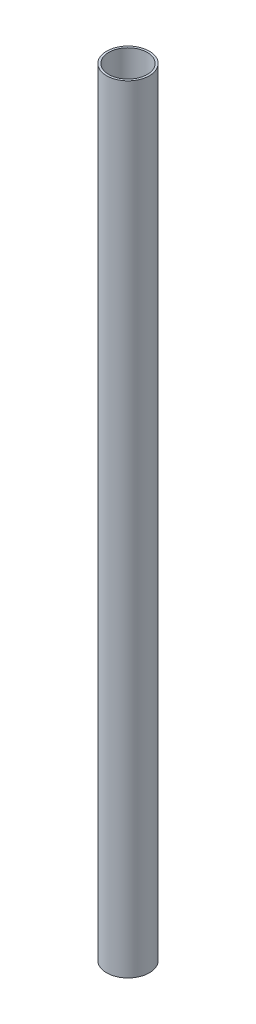
ISO-10303-21;
HEADER;
FILE_DESCRIPTION(('STEP AP214'),'2;1');
FILE_NAME('part.step','',(''),(''),'','','');
FILE_SCHEMA(('AUTOMOTIVE_DESIGN { 1 0 10303 214 1 1 1 1 }'));
ENDSEC;
DATA;
#1=APPLICATION_CONTEXT('core data for automotive mechanical design processes');
#2=APPLICATION_PROTOCOL_DEFINITION('international standard','automotive_design',2000,#1);
#3=PRODUCT_CONTEXT('',#1,'mechanical');
#4=PRODUCT('Part','Part','',(#3));
#5=PRODUCT_RELATED_PRODUCT_CATEGORY('part','',(#4));
#6=PRODUCT_DEFINITION_FORMATION('','',#4);
#7=PRODUCT_DEFINITION_CONTEXT('part definition',#1,'design');
#8=PRODUCT_DEFINITION('design','',#6,#7);
#9=PRODUCT_DEFINITION_SHAPE('','',#8);
#10=(LENGTH_UNIT() NAMED_UNIT(*) SI_UNIT(.MILLI.,.METRE.));
#11=(NAMED_UNIT(*) PLANE_ANGLE_UNIT() SI_UNIT($,.RADIAN.));
#12=(NAMED_UNIT(*) SI_UNIT($,.STERADIAN.) SOLID_ANGLE_UNIT());
#13=UNCERTAINTY_MEASURE_WITH_UNIT(LENGTH_MEASURE(1.E-05),#10,'distance_accuracy_value','');
#14=(GEOMETRIC_REPRESENTATION_CONTEXT(3) GLOBAL_UNCERTAINTY_ASSIGNED_CONTEXT((#13)) GLOBAL_UNIT_ASSIGNED_CONTEXT((#10,
#11,#12)) REPRESENTATION_CONTEXT('',''));
#15=CARTESIAN_POINT('',(0.,0.,0.));
#16=DIRECTION('',(0.,0.,1.));
#17=DIRECTION('',(1.,0.,0.));
#18=AXIS2_PLACEMENT_3D('',#15,#16,#17);
#19=CARTESIAN_POINT('',(0.,577.85,0.));
#20=DIRECTION('',(0.,1.,0.));
#21=DIRECTION('',(0.,0.,1.));
#22=AXIS2_PLACEMENT_3D('',#19,#20,#21);
#23=PLANE('',#22);
#24=CARTESIAN_POINT('',(0.,577.85,0.));
#25=DIRECTION('',(0.,1.,0.));
#26=DIRECTION('',(0.,0.,1.));
#27=AXIS2_PLACEMENT_3D('',#24,#25,#26);
#28=CIRCLE('',#27,15.875);
#29=CARTESIAN_POINT('',(0.,577.85,15.875));
#30=VERTEX_POINT('',#29);
#31=EDGE_CURVE('E10',#30,#30,#28,.T.);
#32=ORIENTED_EDGE('',*,*,#31,.T.);
#33=EDGE_LOOP('',(#32));
#34=FACE_BOUND('',#33,.T.);
#35=CARTESIAN_POINT('',(0.,577.85,0.));
#36=DIRECTION('',(0.,1.,0.));
#37=DIRECTION('',(0.,0.,1.));
#38=AXIS2_PLACEMENT_3D('',#35,#36,#37);
#39=CIRCLE('',#38,14.2875);
#40=CARTESIAN_POINT('',(0.,577.85,14.2875));
#41=VERTEX_POINT('',#40);
#42=EDGE_CURVE('E41',#41,#41,#39,.T.);
#43=ORIENTED_EDGE('',*,*,#42,.F.);
#44=EDGE_LOOP('',(#43));
#45=FACE_BOUND('',#44,.T.);
#46=ADVANCED_FACE('F30',(#34,#45),#23,.T.);
#47=CARTESIAN_POINT('',(0.,0.,0.));
#48=DIRECTION('',(0.,1.,0.));
#49=DIRECTION('',(0.,0.,1.));
#50=AXIS2_PLACEMENT_3D('',#47,#48,#49);
#51=PLANE('',#50);
#52=CARTESIAN_POINT('',(0.,0.,0.));
#53=DIRECTION('',(0.,1.,0.));
#54=DIRECTION('',(0.,0.,1.));
#55=AXIS2_PLACEMENT_3D('',#52,#53,#54);
#56=CIRCLE('',#55,15.875);
#57=CARTESIAN_POINT('',(0.,0.,15.875));
#58=VERTEX_POINT('',#57);
#59=EDGE_CURVE('E34',#58,#58,#56,.T.);
#60=ORIENTED_EDGE('',*,*,#59,.F.);
#61=EDGE_LOOP('',(#60));
#62=FACE_BOUND('',#61,.T.);
#63=CARTESIAN_POINT('',(0.,0.,0.));
#64=DIRECTION('',(0.,1.,0.));
#65=DIRECTION('',(0.,0.,1.));
#66=AXIS2_PLACEMENT_3D('',#63,#64,#65);
#67=CIRCLE('',#66,14.2875);
#68=CARTESIAN_POINT('',(0.,0.,14.2875));
#69=VERTEX_POINT('',#68);
#70=EDGE_CURVE('E43',#69,#69,#67,.T.);
#71=ORIENTED_EDGE('',*,*,#70,.T.);
#72=EDGE_LOOP('',(#71));
#73=FACE_BOUND('',#72,.T.);
#74=ADVANCED_FACE('F53',(#62,#73),#51,.F.);
#75=CARTESIAN_POINT('',(0.,577.85,0.));
#76=DIRECTION('',(0.,-1.,0.));
#77=DIRECTION('',(0.,0.,-1.));
#78=AXIS2_PLACEMENT_3D('',#75,#76,#77);
#79=CYLINDRICAL_SURFACE('',#78,15.875);
#80=ORIENTED_EDGE('',*,*,#31,.F.);
#81=EDGE_LOOP('',(#80));
#82=FACE_BOUND('',#81,.T.);
#83=ORIENTED_EDGE('',*,*,#59,.T.);
#84=EDGE_LOOP('',(#83));
#85=FACE_BOUND('',#84,.T.);
#86=ADVANCED_FACE('F32',(#82,#85),#79,.T.);
#87=CARTESIAN_POINT('',(0.,577.85,0.));
#88=DIRECTION('',(0.,-1.,0.));
#89=DIRECTION('',(0.,0.,-1.));
#90=AXIS2_PLACEMENT_3D('',#87,#88,#89);
#91=CYLINDRICAL_SURFACE('',#90,14.2875);
#92=ORIENTED_EDGE('',*,*,#42,.T.);
#93=EDGE_LOOP('',(#92));
#94=FACE_BOUND('',#93,.T.);
#95=ORIENTED_EDGE('',*,*,#70,.F.);
#96=EDGE_LOOP('',(#95));
#97=FACE_BOUND('',#96,.T.);
#98=ADVANCED_FACE('F49',(#94,#97),#91,.F.);
#99=CLOSED_SHELL('',(#46,#74,#86,#98));
#100=MANIFOLD_SOLID_BREP('B2',#99);
#101=ADVANCED_BREP_SHAPE_REPRESENTATION('',(#18,#100),#14);
#102=SHAPE_DEFINITION_REPRESENTATION(#9,#101);
ENDSEC;
END-ISO-10303-21;
